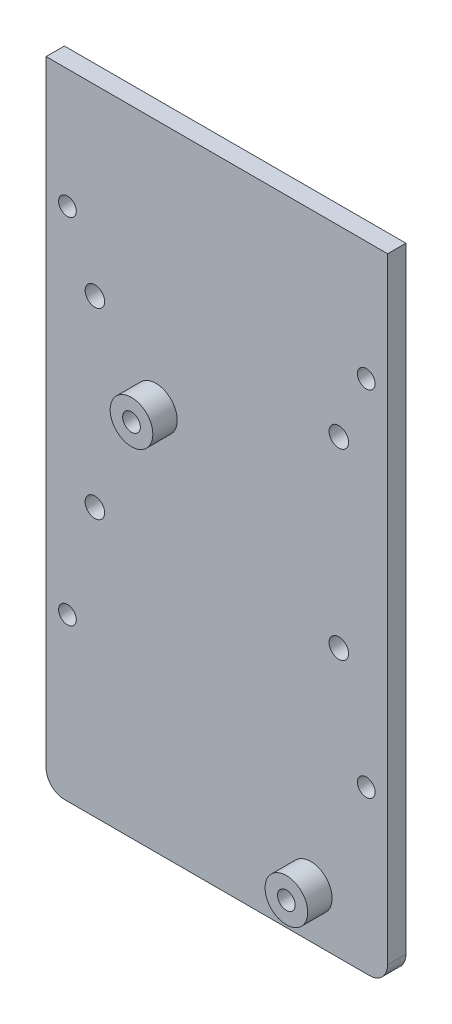
ISO-10303-21;
HEADER;
FILE_DESCRIPTION(('STEP AP214'),'2;1');
FILE_NAME('part.step','',(''),(''),'','','');
FILE_SCHEMA(('AUTOMOTIVE_DESIGN { 1 0 10303 214 1 1 1 1 }'));
ENDSEC;
DATA;
#1=APPLICATION_CONTEXT('core data for automotive mechanical design processes');
#2=APPLICATION_PROTOCOL_DEFINITION('international standard','automotive_design',2000,#1);
#3=PRODUCT_CONTEXT('',#1,'mechanical');
#4=PRODUCT('Part','Part','',(#3));
#5=PRODUCT_RELATED_PRODUCT_CATEGORY('part','',(#4));
#6=PRODUCT_DEFINITION_FORMATION('','',#4);
#7=PRODUCT_DEFINITION_CONTEXT('part definition',#1,'design');
#8=PRODUCT_DEFINITION('design','',#6,#7);
#9=PRODUCT_DEFINITION_SHAPE('','',#8);
#10=(LENGTH_UNIT() NAMED_UNIT(*) SI_UNIT(.MILLI.,.METRE.));
#11=(NAMED_UNIT(*) PLANE_ANGLE_UNIT() SI_UNIT($,.RADIAN.));
#12=(NAMED_UNIT(*) SI_UNIT($,.STERADIAN.) SOLID_ANGLE_UNIT());
#13=UNCERTAINTY_MEASURE_WITH_UNIT(LENGTH_MEASURE(1.E-05),#10,'distance_accuracy_value','');
#14=(GEOMETRIC_REPRESENTATION_CONTEXT(3) GLOBAL_UNCERTAINTY_ASSIGNED_CONTEXT((#13)) GLOBAL_UNIT_ASSIGNED_CONTEXT((#10,
#11,#12)) REPRESENTATION_CONTEXT('',''));
#15=CARTESIAN_POINT('',(0.,0.,0.));
#16=DIRECTION('',(0.,0.,1.));
#17=DIRECTION('',(1.,0.,0.));
#18=AXIS2_PLACEMENT_3D('',#15,#16,#17);
#19=CARTESIAN_POINT('',(-55.5668385634465,-35.1317121332508,3.));
#20=DIRECTION('',(0.,0.,1.));
#21=DIRECTION('',(1.,0.,0.));
#22=AXIS2_PLACEMENT_3D('',#19,#20,#21);
#23=PLANE('',#22);
#24=CARTESIAN_POINT('',(-15.1668385634479,-30.2317121332502,3.));
#25=DIRECTION('',(0.,0.,1.));
#26=DIRECTION('',(1.,0.,0.));
#27=AXIS2_PLACEMENT_3D('',#24,#25,#26);
#28=CIRCLE('',#27,3.5);
#29=CARTESIAN_POINT('',(-11.6668385634479,-30.2317121332502,3.));
#30=VERTEX_POINT('',#29);
#31=EDGE_CURVE('E229',#30,#30,#28,.T.);
#32=ORIENTED_EDGE('',*,*,#31,.F.);
#33=EDGE_LOOP('',(#32));
#34=FACE_BOUND('',#33,.T.);
#35=CARTESIAN_POINT('',(-55.0668385634466,46.3682878667495,3.));
#36=DIRECTION('',(0.,0.,1.));
#37=DIRECTION('',(-1.,0.,0.));
#38=AXIS2_PLACEMENT_3D('',#35,#36,#37);
#39=CIRCLE('',#38,1.45);
#40=CARTESIAN_POINT('',(-56.5168385634466,46.3682878667495,3.));
#41=VERTEX_POINT('',#40);
#42=EDGE_CURVE('E243',#41,#41,#39,.T.);
#43=ORIENTED_EDGE('',*,*,#42,.F.);
#44=EDGE_LOOP('',(#43));
#45=FACE_BOUND('',#44,.T.);
#46=CARTESIAN_POINT('',(-55.066838563447,-11.6317121332505,3.));
#47=DIRECTION('',(0.,0.,1.));
#48=DIRECTION('',(-1.,0.,0.));
#49=AXIS2_PLACEMENT_3D('',#46,#47,#48);
#50=CIRCLE('',#49,1.45);
#51=CARTESIAN_POINT('',(-56.516838563447,-11.6317121332505,3.));
#52=VERTEX_POINT('',#51);
#53=EDGE_CURVE('E248',#52,#52,#50,.T.);
#54=ORIENTED_EDGE('',*,*,#53,.F.);
#55=EDGE_LOOP('',(#54));
#56=FACE_BOUND('',#55,.T.);
#57=CARTESIAN_POINT('',(-6.06683856344624,-11.6317121332507,3.));
#58=DIRECTION('',(0.,0.,1.));
#59=DIRECTION('',(1.,0.,0.));
#60=AXIS2_PLACEMENT_3D('',#57,#58,#59);
#61=CIRCLE('',#60,1.45);
#62=CARTESIAN_POINT('',(-4.61683856344624,-11.6317121332507,3.));
#63=VERTEX_POINT('',#62);
#64=EDGE_CURVE('E254',#63,#63,#61,.T.);
#65=ORIENTED_EDGE('',*,*,#64,.F.);
#66=EDGE_LOOP('',(#65));
#67=FACE_BOUND('',#66,.T.);
#68=CARTESIAN_POINT('',(-6.06683856344624,46.3682878667493,3.));
#69=DIRECTION('',(0.,0.,1.));
#70=DIRECTION('',(1.,0.,0.));
#71=AXIS2_PLACEMENT_3D('',#68,#69,#70);
#72=CIRCLE('',#71,1.45);
#73=CARTESIAN_POINT('',(-4.61683856344624,46.3682878667493,3.));
#74=VERTEX_POINT('',#73);
#75=EDGE_CURVE('E260',#74,#74,#72,.T.);
#76=ORIENTED_EDGE('',*,*,#75,.F.);
#77=EDGE_LOOP('',(#76));
#78=FACE_BOUND('',#77,.T.);
#79=CARTESIAN_POINT('',(-10.5668385634465,35.8682878667493,3.));
#80=DIRECTION('',(0.,0.,1.));
#81=DIRECTION('',(-1.,0.,0.));
#82=AXIS2_PLACEMENT_3D('',#79,#80,#81);
#83=CIRCLE('',#82,1.60000000000023);
#84=CARTESIAN_POINT('',(-12.1668385634468,35.8682878667493,3.));
#85=VERTEX_POINT('',#84);
#86=EDGE_CURVE('E274',#85,#85,#83,.T.);
#87=ORIENTED_EDGE('',*,*,#86,.F.);
#88=EDGE_LOOP('',(#87));
#89=FACE_BOUND('',#88,.T.);
#90=CARTESIAN_POINT('',(-10.5668385634465,5.86828786674929,3.));
#91=DIRECTION('',(0.,0.,1.));
#92=DIRECTION('',(-1.,0.,0.));
#93=AXIS2_PLACEMENT_3D('',#90,#91,#92);
#94=CIRCLE('',#93,1.60000000000001);
#95=CARTESIAN_POINT('',(-12.1668385634465,5.86828786674929,3.));
#96=VERTEX_POINT('',#95);
#97=EDGE_CURVE('E278',#96,#96,#94,.T.);
#98=ORIENTED_EDGE('',*,*,#97,.F.);
#99=EDGE_LOOP('',(#98));
#100=FACE_BOUND('',#99,.T.);
#101=CARTESIAN_POINT('',(-50.5668385634463,5.86828786674928,3.));
#102=DIRECTION('',(0.,0.,1.));
#103=DIRECTION('',(1.,0.,0.));
#104=AXIS2_PLACEMENT_3D('',#101,#102,#103);
#105=CIRCLE('',#104,1.60000000000001);
#106=CARTESIAN_POINT('',(-48.9668385634463,5.86828786674928,3.));
#107=VERTEX_POINT('',#106);
#108=EDGE_CURVE('E284',#107,#107,#105,.T.);
#109=ORIENTED_EDGE('',*,*,#108,.F.);
#110=EDGE_LOOP('',(#109));
#111=FACE_BOUND('',#110,.T.);
#112=CARTESIAN_POINT('',(-50.5668385634462,35.8682878667493,3.));
#113=DIRECTION('',(0.,0.,1.));
#114=DIRECTION('',(1.,0.,0.));
#115=AXIS2_PLACEMENT_3D('',#112,#113,#114);
#116=CIRCLE('',#115,1.60000000000023);
#117=CARTESIAN_POINT('',(-48.966838563446,35.8682878667493,3.));
#118=VERTEX_POINT('',#117);
#119=EDGE_CURVE('E290',#118,#118,#116,.T.);
#120=ORIENTED_EDGE('',*,*,#119,.F.);
#121=EDGE_LOOP('',(#120));
#122=FACE_BOUND('',#121,.T.);
#123=CARTESIAN_POINT('',(-55.5668385634465,-35.1317121332508,3.));
#124=DIRECTION('',(0.,0.,1.));
#125=DIRECTION('',(1.,0.,0.));
#126=AXIS2_PLACEMENT_3D('',#123,#124,#125);
#127=CIRCLE('',#126,2.99999999999995);
#128=CARTESIAN_POINT('',(-58.5668385634464,-35.1317121332508,3.));
#129=VERTEX_POINT('',#128);
#130=CARTESIAN_POINT('',(-55.5668385634479,-38.1317121332507,3.));
#131=VERTEX_POINT('',#130);
#132=EDGE_CURVE('E132',#129,#131,#127,.T.);
#133=ORIENTED_EDGE('',*,*,#132,.T.);
#134=DIRECTION('',(1.,0.,0.));
#135=VECTOR('',#134,1.);
#136=CARTESIAN_POINT('',(-55.5668385634479,-38.1317121332507,3.));
#137=LINE('',#136,#135);
#138=CARTESIAN_POINT('',(-5.56683856344491,-38.1317121332507,3.));
#139=VERTEX_POINT('',#138);
#140=EDGE_CURVE('E90',#131,#139,#137,.T.);
#141=ORIENTED_EDGE('',*,*,#140,.T.);
#142=CARTESIAN_POINT('',(-5.56683856344638,-35.1317121332506,3.));
#143=DIRECTION('',(0.,0.,1.));
#144=DIRECTION('',(1.,0.,0.));
#145=AXIS2_PLACEMENT_3D('',#142,#143,#144);
#146=CIRCLE('',#145,3.00000000000013);
#147=CARTESIAN_POINT('',(-2.56683856344624,-35.1317121332507,3.));
#148=VERTEX_POINT('',#147);
#149=EDGE_CURVE('E103',#139,#148,#146,.T.);
#150=ORIENTED_EDGE('',*,*,#149,.T.);
#151=DIRECTION('',(0.,1.,0.));
#152=VECTOR('',#151,1.);
#153=CARTESIAN_POINT('',(-2.56683856344624,-35.1317121332507,3.));
#154=LINE('',#153,#152);
#155=CARTESIAN_POINT('',(-2.56683856344624,65.8682878667496,3.));
#156=VERTEX_POINT('',#155);
#157=EDGE_CURVE('E97',#148,#156,#154,.T.);
#158=ORIENTED_EDGE('',*,*,#157,.T.);
#159=DIRECTION('',(-1.,0.,0.));
#160=VECTOR('',#159,1.);
#161=CARTESIAN_POINT('',(-2.56683856344624,65.8682878667496,3.));
#162=LINE('',#161,#160);
#163=CARTESIAN_POINT('',(-58.5668385634464,65.8682878667493,3.));
#164=VERTEX_POINT('',#163);
#165=EDGE_CURVE('E101',#156,#164,#162,.T.);
#166=ORIENTED_EDGE('',*,*,#165,.T.);
#167=DIRECTION('',(0.,-1.,0.));
#168=VECTOR('',#167,1.);
#169=CARTESIAN_POINT('',(-58.5668385634464,65.8682878667493,3.));
#170=LINE('',#169,#168);
#171=EDGE_CURVE('E53',#164,#129,#170,.T.);
#172=ORIENTED_EDGE('',*,*,#171,.T.);
#173=EDGE_LOOP('',(#133,#141,#150,#158,#166,#172));
#174=FACE_BOUND('',#173,.T.);
#175=CARTESIAN_POINT('',(-40.5668385634471,24.9682878667495,3.));
#176=DIRECTION('',(0.,0.,1.));
#177=DIRECTION('',(1.,0.,0.));
#178=AXIS2_PLACEMENT_3D('',#175,#176,#177);
#179=CIRCLE('',#178,3.5);
#180=CARTESIAN_POINT('',(-37.0668385634471,24.9682878667495,3.));
#181=VERTEX_POINT('',#180);
#182=EDGE_CURVE('E234',#181,#181,#179,.T.);
#183=ORIENTED_EDGE('',*,*,#182,.F.);
#184=EDGE_LOOP('',(#183));
#185=FACE_BOUND('',#184,.T.);
#186=ADVANCED_FACE('F36',(#34,#45,#56,#67,#78,#89,#100,#111,#122,#174,#185),#23,.T.);
#187=CARTESIAN_POINT('',(-55.5668385634465,-35.1317121332508,3.));
#188=DIRECTION('',(0.,0.,-1.));
#189=DIRECTION('',(-1.,0.,0.));
#190=AXIS2_PLACEMENT_3D('',#187,#188,#189);
#191=CYLINDRICAL_SURFACE('',#190,2.99999999999995);
#192=CARTESIAN_POINT('',(-55.5668385634465,-35.1317121332508,0.));
#193=DIRECTION('',(0.,0.,1.));
#194=DIRECTION('',(1.,0.,0.));
#195=AXIS2_PLACEMENT_3D('',#192,#193,#194);
#196=CIRCLE('',#195,2.99999999999995);
#197=CARTESIAN_POINT('',(-58.5668385634464,-35.1317121332508,0.));
#198=VERTEX_POINT('',#197);
#199=CARTESIAN_POINT('',(-55.5668385634479,-38.1317121332507,0.));
#200=VERTEX_POINT('',#199);
#201=EDGE_CURVE('E121',#198,#200,#196,.T.);
#202=ORIENTED_EDGE('',*,*,#201,.T.);
#203=DIRECTION('',(0.,0.,-1.));
#204=VECTOR('',#203,1.);
#205=CARTESIAN_POINT('',(-55.5668385634479,-38.1317121332507,3.));
#206=LINE('',#205,#204);
#207=EDGE_CURVE('E11',#131,#200,#206,.T.);
#208=ORIENTED_EDGE('',*,*,#207,.F.);
#209=ORIENTED_EDGE('',*,*,#132,.F.);
#210=DIRECTION('',(0.,0.,-1.));
#211=VECTOR('',#210,1.);
#212=CARTESIAN_POINT('',(-58.5668385634464,-35.1317121332508,3.));
#213=LINE('',#212,#211);
#214=EDGE_CURVE('E117',#129,#198,#213,.T.);
#215=ORIENTED_EDGE('',*,*,#214,.T.);
#216=EDGE_LOOP('',(#202,#208,#209,#215));
#217=FACE_BOUND('',#216,.T.);
#218=ADVANCED_FACE('F38',(#217),#191,.T.);
#219=CARTESIAN_POINT('',(-55.5668385634479,-38.1317121332507,3.));
#220=DIRECTION('',(0.,1.,0.));
#221=DIRECTION('',(0.,0.,1.));
#222=AXIS2_PLACEMENT_3D('',#219,#220,#221);
#223=PLANE('',#222);
#224=DIRECTION('',(1.,0.,0.));
#225=VECTOR('',#224,1.);
#226=CARTESIAN_POINT('',(-55.5668385634479,-38.1317121332507,0.));
#227=LINE('',#226,#225);
#228=CARTESIAN_POINT('',(-5.56683856344491,-38.1317121332507,0.));
#229=VERTEX_POINT('',#228);
#230=EDGE_CURVE('E124',#200,#229,#227,.T.);
#231=ORIENTED_EDGE('',*,*,#230,.T.);
#232=DIRECTION('',(0.,0.,-1.));
#233=VECTOR('',#232,1.);
#234=CARTESIAN_POINT('',(-5.56683856344491,-38.1317121332507,3.));
#235=LINE('',#234,#233);
#236=EDGE_CURVE('E45',#139,#229,#235,.T.);
#237=ORIENTED_EDGE('',*,*,#236,.F.);
#238=ORIENTED_EDGE('',*,*,#140,.F.);
#239=ORIENTED_EDGE('',*,*,#207,.T.);
#240=EDGE_LOOP('',(#231,#237,#238,#239));
#241=FACE_BOUND('',#240,.T.);
#242=ADVANCED_FACE('F162',(#241),#223,.F.);
#243=CARTESIAN_POINT('',(-5.56683856344638,-35.1317121332506,3.));
#244=DIRECTION('',(0.,0.,-1.));
#245=DIRECTION('',(-1.,0.,0.));
#246=AXIS2_PLACEMENT_3D('',#243,#244,#245);
#247=CYLINDRICAL_SURFACE('',#246,3.00000000000013);
#248=CARTESIAN_POINT('',(-5.56683856344638,-35.1317121332506,0.));
#249=DIRECTION('',(0.,0.,1.));
#250=DIRECTION('',(1.,0.,0.));
#251=AXIS2_PLACEMENT_3D('',#248,#249,#250);
#252=CIRCLE('',#251,3.00000000000013);
#253=CARTESIAN_POINT('',(-2.56683856344624,-35.1317121332507,0.));
#254=VERTEX_POINT('',#253);
#255=EDGE_CURVE('E127',#229,#254,#252,.T.);
#256=ORIENTED_EDGE('',*,*,#255,.T.);
#257=DIRECTION('',(0.,0.,-1.));
#258=VECTOR('',#257,1.);
#259=CARTESIAN_POINT('',(-2.56683856344624,-35.1317121332507,3.));
#260=LINE('',#259,#258);
#261=EDGE_CURVE('E112',#148,#254,#260,.T.);
#262=ORIENTED_EDGE('',*,*,#261,.F.);
#263=ORIENTED_EDGE('',*,*,#149,.F.);
#264=ORIENTED_EDGE('',*,*,#236,.T.);
#265=EDGE_LOOP('',(#256,#262,#263,#264));
#266=FACE_BOUND('',#265,.T.);
#267=ADVANCED_FACE('F138',(#266),#247,.T.);
#268=CARTESIAN_POINT('',(-2.56683856344624,-35.1317121332507,3.));
#269=DIRECTION('',(-1.,0.,0.));
#270=DIRECTION('',(0.,0.,1.));
#271=AXIS2_PLACEMENT_3D('',#268,#269,#270);
#272=PLANE('',#271);
#273=DIRECTION('',(0.,1.,0.));
#274=VECTOR('',#273,1.);
#275=CARTESIAN_POINT('',(-2.56683856344624,-35.1317121332507,0.));
#276=LINE('',#275,#274);
#277=CARTESIAN_POINT('',(-2.56683856344624,65.8682878667496,0.));
#278=VERTEX_POINT('',#277);
#279=EDGE_CURVE('E111',#254,#278,#276,.T.);
#280=ORIENTED_EDGE('',*,*,#279,.T.);
#281=DIRECTION('',(0.,0.,-1.));
#282=VECTOR('',#281,1.);
#283=CARTESIAN_POINT('',(-2.56683856344624,65.8682878667496,3.));
#284=LINE('',#283,#282);
#285=EDGE_CURVE('E108',#156,#278,#284,.T.);
#286=ORIENTED_EDGE('',*,*,#285,.F.);
#287=ORIENTED_EDGE('',*,*,#157,.F.);
#288=ORIENTED_EDGE('',*,*,#261,.T.);
#289=EDGE_LOOP('',(#280,#286,#287,#288));
#290=FACE_BOUND('',#289,.T.);
#291=ADVANCED_FACE('F109',(#290),#272,.F.);
#292=CARTESIAN_POINT('',(-2.56683856344624,65.8682878667496,3.));
#293=DIRECTION('',(0.,-1.,0.));
#294=DIRECTION('',(1.,0.,0.));
#295=AXIS2_PLACEMENT_3D('',#292,#293,#294);
#296=PLANE('',#295);
#297=DIRECTION('',(-1.,0.,0.));
#298=VECTOR('',#297,1.);
#299=CARTESIAN_POINT('',(-2.56683856344624,65.8682878667496,0.));
#300=LINE('',#299,#298);
#301=CARTESIAN_POINT('',(-58.5668385634464,65.8682878667493,0.));
#302=VERTEX_POINT('',#301);
#303=EDGE_CURVE('E76',#278,#302,#300,.T.);
#304=ORIENTED_EDGE('',*,*,#303,.T.);
#305=DIRECTION('',(0.,0.,-1.));
#306=VECTOR('',#305,1.);
#307=CARTESIAN_POINT('',(-58.5668385634464,65.8682878667493,3.));
#308=LINE('',#307,#306);
#309=EDGE_CURVE('E113',#164,#302,#308,.T.);
#310=ORIENTED_EDGE('',*,*,#309,.F.);
#311=ORIENTED_EDGE('',*,*,#165,.F.);
#312=ORIENTED_EDGE('',*,*,#285,.T.);
#313=EDGE_LOOP('',(#304,#310,#311,#312));
#314=FACE_BOUND('',#313,.T.);
#315=ADVANCED_FACE('F115',(#314),#296,.F.);
#316=CARTESIAN_POINT('',(-58.5668385634464,65.8682878667493,3.));
#317=DIRECTION('',(1.,0.,0.));
#318=DIRECTION('',(0.,0.,-1.));
#319=AXIS2_PLACEMENT_3D('',#316,#317,#318);
#320=PLANE('',#319);
#321=DIRECTION('',(0.,-1.,0.));
#322=VECTOR('',#321,1.);
#323=CARTESIAN_POINT('',(-58.5668385634464,65.8682878667493,0.));
#324=LINE('',#323,#322);
#325=EDGE_CURVE('E82',#302,#198,#324,.T.);
#326=ORIENTED_EDGE('',*,*,#325,.T.);
#327=ORIENTED_EDGE('',*,*,#214,.F.);
#328=ORIENTED_EDGE('',*,*,#171,.F.);
#329=ORIENTED_EDGE('',*,*,#309,.T.);
#330=EDGE_LOOP('',(#326,#327,#328,#329));
#331=FACE_BOUND('',#330,.T.);
#332=ADVANCED_FACE('F145',(#331),#320,.F.);
#333=CARTESIAN_POINT('',(-55.5668385634465,-35.1317121332508,0.));
#334=DIRECTION('',(0.,0.,1.));
#335=DIRECTION('',(1.,0.,0.));
#336=AXIS2_PLACEMENT_3D('',#333,#334,#335);
#337=PLANE('',#336);
#338=CARTESIAN_POINT('',(-55.0668385634466,46.3682878667495,0.));
#339=DIRECTION('',(0.,0.,1.));
#340=DIRECTION('',(-1.,0.,0.));
#341=AXIS2_PLACEMENT_3D('',#338,#339,#340);
#342=CIRCLE('',#341,1.45);
#343=CARTESIAN_POINT('',(-56.5168385634466,46.3682878667495,0.));
#344=VERTEX_POINT('',#343);
#345=EDGE_CURVE('E245',#344,#344,#342,.T.);
#346=ORIENTED_EDGE('',*,*,#345,.T.);
#347=EDGE_LOOP('',(#346));
#348=FACE_BOUND('',#347,.T.);
#349=CARTESIAN_POINT('',(-55.066838563447,-11.6317121332505,0.));
#350=DIRECTION('',(0.,0.,1.));
#351=DIRECTION('',(-1.,0.,0.));
#352=AXIS2_PLACEMENT_3D('',#349,#350,#351);
#353=CIRCLE('',#352,1.45);
#354=CARTESIAN_POINT('',(-56.516838563447,-11.6317121332505,0.));
#355=VERTEX_POINT('',#354);
#356=EDGE_CURVE('E251',#355,#355,#353,.T.);
#357=ORIENTED_EDGE('',*,*,#356,.T.);
#358=EDGE_LOOP('',(#357));
#359=FACE_BOUND('',#358,.T.);
#360=CARTESIAN_POINT('',(-6.06683856344624,-11.6317121332507,0.));
#361=DIRECTION('',(0.,0.,1.));
#362=DIRECTION('',(1.,0.,0.));
#363=AXIS2_PLACEMENT_3D('',#360,#361,#362);
#364=CIRCLE('',#363,1.45);
#365=CARTESIAN_POINT('',(-4.61683856344624,-11.6317121332507,0.));
#366=VERTEX_POINT('',#365);
#367=EDGE_CURVE('E257',#366,#366,#364,.T.);
#368=ORIENTED_EDGE('',*,*,#367,.T.);
#369=EDGE_LOOP('',(#368));
#370=FACE_BOUND('',#369,.T.);
#371=CARTESIAN_POINT('',(-6.06683856344624,46.3682878667493,0.));
#372=DIRECTION('',(0.,0.,1.));
#373=DIRECTION('',(1.,0.,0.));
#374=AXIS2_PLACEMENT_3D('',#371,#372,#373);
#375=CIRCLE('',#374,1.45);
#376=CARTESIAN_POINT('',(-4.61683856344624,46.3682878667493,0.));
#377=VERTEX_POINT('',#376);
#378=EDGE_CURVE('E263',#377,#377,#375,.T.);
#379=ORIENTED_EDGE('',*,*,#378,.T.);
#380=EDGE_LOOP('',(#379));
#381=FACE_BOUND('',#380,.T.);
#382=CARTESIAN_POINT('',(-15.1668385634479,-30.2317121332502,0.));
#383=DIRECTION('',(0.,0.,1.));
#384=DIRECTION('',(1.,0.,0.));
#385=AXIS2_PLACEMENT_3D('',#382,#383,#384);
#386=CIRCLE('',#385,1.45);
#387=CARTESIAN_POINT('',(-13.7168385634479,-30.2317121332502,0.));
#388=VERTEX_POINT('',#387);
#389=EDGE_CURVE('E266',#388,#388,#386,.T.);
#390=ORIENTED_EDGE('',*,*,#389,.T.);
#391=EDGE_LOOP('',(#390));
#392=FACE_BOUND('',#391,.T.);
#393=CARTESIAN_POINT('',(-40.5668385634471,24.9682878667495,0.));
#394=DIRECTION('',(0.,0.,1.));
#395=DIRECTION('',(1.,0.,0.));
#396=AXIS2_PLACEMENT_3D('',#393,#394,#395);
#397=CIRCLE('',#396,1.45);
#398=CARTESIAN_POINT('',(-39.1168385634471,24.9682878667495,0.));
#399=VERTEX_POINT('',#398);
#400=EDGE_CURVE('E271',#399,#399,#397,.T.);
#401=ORIENTED_EDGE('',*,*,#400,.T.);
#402=EDGE_LOOP('',(#401));
#403=FACE_BOUND('',#402,.T.);
#404=CARTESIAN_POINT('',(-10.5668385634465,35.8682878667493,0.));
#405=DIRECTION('',(0.,0.,1.));
#406=DIRECTION('',(-1.,0.,0.));
#407=AXIS2_PLACEMENT_3D('',#404,#405,#406);
#408=CIRCLE('',#407,1.60000000000023);
#409=CARTESIAN_POINT('',(-12.1668385634468,35.8682878667493,0.));
#410=VERTEX_POINT('',#409);
#411=EDGE_CURVE('E275',#410,#410,#408,.T.);
#412=ORIENTED_EDGE('',*,*,#411,.T.);
#413=EDGE_LOOP('',(#412));
#414=FACE_BOUND('',#413,.T.);
#415=CARTESIAN_POINT('',(-10.5668385634465,5.86828786674929,0.));
#416=DIRECTION('',(0.,0.,1.));
#417=DIRECTION('',(-1.,0.,0.));
#418=AXIS2_PLACEMENT_3D('',#415,#416,#417);
#419=CIRCLE('',#418,1.60000000000001);
#420=CARTESIAN_POINT('',(-12.1668385634465,5.86828786674929,0.));
#421=VERTEX_POINT('',#420);
#422=EDGE_CURVE('E281',#421,#421,#419,.T.);
#423=ORIENTED_EDGE('',*,*,#422,.T.);
#424=EDGE_LOOP('',(#423));
#425=FACE_BOUND('',#424,.T.);
#426=CARTESIAN_POINT('',(-50.5668385634463,5.86828786674928,0.));
#427=DIRECTION('',(0.,0.,1.));
#428=DIRECTION('',(1.,0.,0.));
#429=AXIS2_PLACEMENT_3D('',#426,#427,#428);
#430=CIRCLE('',#429,1.60000000000001);
#431=CARTESIAN_POINT('',(-48.9668385634463,5.86828786674928,0.));
#432=VERTEX_POINT('',#431);
#433=EDGE_CURVE('E287',#432,#432,#430,.T.);
#434=ORIENTED_EDGE('',*,*,#433,.T.);
#435=EDGE_LOOP('',(#434));
#436=FACE_BOUND('',#435,.T.);
#437=CARTESIAN_POINT('',(-50.5668385634462,35.8682878667493,0.));
#438=DIRECTION('',(0.,0.,1.));
#439=DIRECTION('',(1.,0.,0.));
#440=AXIS2_PLACEMENT_3D('',#437,#438,#439);
#441=CIRCLE('',#440,1.60000000000023);
#442=CARTESIAN_POINT('',(-48.966838563446,35.8682878667493,0.));
#443=VERTEX_POINT('',#442);
#444=EDGE_CURVE('E125',#443,#443,#441,.T.);
#445=ORIENTED_EDGE('',*,*,#444,.T.);
#446=EDGE_LOOP('',(#445));
#447=FACE_BOUND('',#446,.T.);
#448=ORIENTED_EDGE('',*,*,#201,.F.);
#449=ORIENTED_EDGE('',*,*,#325,.F.);
#450=ORIENTED_EDGE('',*,*,#303,.F.);
#451=ORIENTED_EDGE('',*,*,#279,.F.);
#452=ORIENTED_EDGE('',*,*,#255,.F.);
#453=ORIENTED_EDGE('',*,*,#230,.F.);
#454=EDGE_LOOP('',(#448,#449,#450,#451,#452,#453));
#455=FACE_BOUND('',#454,.T.);
#456=ADVANCED_FACE('F141',(#348,#359,#370,#381,#392,#403,#414,#425,#436,#447,#455),#337,.F.);
#457=CARTESIAN_POINT('',(-50.5668385634462,35.8682878667493,0.));
#458=DIRECTION('',(0.,0.,1.));
#459=DIRECTION('',(1.,0.,0.));
#460=AXIS2_PLACEMENT_3D('',#457,#458,#459);
#461=CYLINDRICAL_SURFACE('',#460,1.60000000000023);
#462=ORIENTED_EDGE('',*,*,#444,.F.);
#463=EDGE_LOOP('',(#462));
#464=FACE_BOUND('',#463,.T.);
#465=ORIENTED_EDGE('',*,*,#119,.T.);
#466=EDGE_LOOP('',(#465));
#467=FACE_BOUND('',#466,.T.);
#468=ADVANCED_FACE('F152',(#464,#467),#461,.F.);
#469=CARTESIAN_POINT('',(-50.5668385634463,5.86828786674928,0.));
#470=DIRECTION('',(0.,0.,1.));
#471=DIRECTION('',(1.,0.,0.));
#472=AXIS2_PLACEMENT_3D('',#469,#470,#471);
#473=CYLINDRICAL_SURFACE('',#472,1.60000000000001);
#474=ORIENTED_EDGE('',*,*,#433,.F.);
#475=EDGE_LOOP('',(#474));
#476=FACE_BOUND('',#475,.T.);
#477=ORIENTED_EDGE('',*,*,#108,.T.);
#478=EDGE_LOOP('',(#477));
#479=FACE_BOUND('',#478,.T.);
#480=ADVANCED_FACE('F168',(#476,#479),#473,.F.);
#481=CARTESIAN_POINT('',(-10.5668385634465,5.86828786674929,0.));
#482=DIRECTION('',(0.,0.,1.));
#483=DIRECTION('',(1.,0.,0.));
#484=AXIS2_PLACEMENT_3D('',#481,#482,#483);
#485=CYLINDRICAL_SURFACE('',#484,1.60000000000001);
#486=ORIENTED_EDGE('',*,*,#422,.F.);
#487=EDGE_LOOP('',(#486));
#488=FACE_BOUND('',#487,.T.);
#489=ORIENTED_EDGE('',*,*,#97,.T.);
#490=EDGE_LOOP('',(#489));
#491=FACE_BOUND('',#490,.T.);
#492=ADVANCED_FACE('F172',(#488,#491),#485,.F.);
#493=CARTESIAN_POINT('',(-10.5668385634465,35.8682878667493,0.));
#494=DIRECTION('',(0.,0.,1.));
#495=DIRECTION('',(1.,0.,0.));
#496=AXIS2_PLACEMENT_3D('',#493,#494,#495);
#497=CYLINDRICAL_SURFACE('',#496,1.60000000000023);
#498=ORIENTED_EDGE('',*,*,#411,.F.);
#499=EDGE_LOOP('',(#498));
#500=FACE_BOUND('',#499,.T.);
#501=ORIENTED_EDGE('',*,*,#86,.T.);
#502=EDGE_LOOP('',(#501));
#503=FACE_BOUND('',#502,.T.);
#504=ADVANCED_FACE('F176',(#500,#503),#497,.F.);
#505=CARTESIAN_POINT('',(-40.5668385634471,24.9682878667495,0.));
#506=DIRECTION('',(0.,0.,1.));
#507=DIRECTION('',(1.,0.,0.));
#508=AXIS2_PLACEMENT_3D('',#505,#506,#507);
#509=CYLINDRICAL_SURFACE('',#508,1.45);
#510=ORIENTED_EDGE('',*,*,#400,.F.);
#511=EDGE_LOOP('',(#510));
#512=FACE_BOUND('',#511,.T.);
#513=CARTESIAN_POINT('',(-40.5668385634471,24.9682878667495,7.));
#514=DIRECTION('',(0.,0.,1.));
#515=DIRECTION('',(1.,0.,0.));
#516=AXIS2_PLACEMENT_3D('',#513,#514,#515);
#517=CIRCLE('',#516,1.45);
#518=CARTESIAN_POINT('',(-39.1168385634471,24.9682878667495,7.));
#519=VERTEX_POINT('',#518);
#520=EDGE_CURVE('E225',#519,#519,#517,.F.);
#521=ORIENTED_EDGE('',*,*,#520,.F.);
#522=EDGE_LOOP('',(#521));
#523=FACE_BOUND('',#522,.T.);
#524=ADVANCED_FACE('F180',(#512,#523),#509,.F.);
#525=CARTESIAN_POINT('',(-15.1668385634479,-30.2317121332502,0.));
#526=DIRECTION('',(0.,0.,1.));
#527=DIRECTION('',(1.,0.,0.));
#528=AXIS2_PLACEMENT_3D('',#525,#526,#527);
#529=CYLINDRICAL_SURFACE('',#528,1.45);
#530=ORIENTED_EDGE('',*,*,#389,.F.);
#531=EDGE_LOOP('',(#530));
#532=FACE_BOUND('',#531,.T.);
#533=CARTESIAN_POINT('',(-15.1668385634479,-30.2317121332502,7.));
#534=DIRECTION('',(0.,0.,1.));
#535=DIRECTION('',(1.,0.,0.));
#536=AXIS2_PLACEMENT_3D('',#533,#534,#535);
#537=CIRCLE('',#536,1.45);
#538=CARTESIAN_POINT('',(-13.7168385634479,-30.2317121332502,7.));
#539=VERTEX_POINT('',#538);
#540=EDGE_CURVE('E232',#539,#539,#537,.F.);
#541=ORIENTED_EDGE('',*,*,#540,.F.);
#542=EDGE_LOOP('',(#541));
#543=FACE_BOUND('',#542,.T.);
#544=ADVANCED_FACE('F184',(#532,#543),#529,.F.);
#545=CARTESIAN_POINT('',(-6.06683856344624,46.3682878667493,0.));
#546=DIRECTION('',(0.,0.,1.));
#547=DIRECTION('',(1.,0.,0.));
#548=AXIS2_PLACEMENT_3D('',#545,#546,#547);
#549=CYLINDRICAL_SURFACE('',#548,1.45);
#550=ORIENTED_EDGE('',*,*,#378,.F.);
#551=EDGE_LOOP('',(#550));
#552=FACE_BOUND('',#551,.T.);
#553=ORIENTED_EDGE('',*,*,#75,.T.);
#554=EDGE_LOOP('',(#553));
#555=FACE_BOUND('',#554,.T.);
#556=ADVANCED_FACE('F188',(#552,#555),#549,.F.);
#557=CARTESIAN_POINT('',(-6.06683856344624,-11.6317121332507,0.));
#558=DIRECTION('',(0.,0.,1.));
#559=DIRECTION('',(1.,0.,0.));
#560=AXIS2_PLACEMENT_3D('',#557,#558,#559);
#561=CYLINDRICAL_SURFACE('',#560,1.45);
#562=ORIENTED_EDGE('',*,*,#367,.F.);
#563=EDGE_LOOP('',(#562));
#564=FACE_BOUND('',#563,.T.);
#565=ORIENTED_EDGE('',*,*,#64,.T.);
#566=EDGE_LOOP('',(#565));
#567=FACE_BOUND('',#566,.T.);
#568=ADVANCED_FACE('F192',(#564,#567),#561,.F.);
#569=CARTESIAN_POINT('',(-55.066838563447,-11.6317121332505,0.));
#570=DIRECTION('',(0.,0.,1.));
#571=DIRECTION('',(1.,0.,0.));
#572=AXIS2_PLACEMENT_3D('',#569,#570,#571);
#573=CYLINDRICAL_SURFACE('',#572,1.45);
#574=ORIENTED_EDGE('',*,*,#356,.F.);
#575=EDGE_LOOP('',(#574));
#576=FACE_BOUND('',#575,.T.);
#577=ORIENTED_EDGE('',*,*,#53,.T.);
#578=EDGE_LOOP('',(#577));
#579=FACE_BOUND('',#578,.T.);
#580=ADVANCED_FACE('F196',(#576,#579),#573,.F.);
#581=CARTESIAN_POINT('',(-55.0668385634466,46.3682878667495,0.));
#582=DIRECTION('',(0.,0.,1.));
#583=DIRECTION('',(1.,0.,0.));
#584=AXIS2_PLACEMENT_3D('',#581,#582,#583);
#585=CYLINDRICAL_SURFACE('',#584,1.45);
#586=ORIENTED_EDGE('',*,*,#345,.F.);
#587=EDGE_LOOP('',(#586));
#588=FACE_BOUND('',#587,.T.);
#589=ORIENTED_EDGE('',*,*,#42,.T.);
#590=EDGE_LOOP('',(#589));
#591=FACE_BOUND('',#590,.T.);
#592=ADVANCED_FACE('F200',(#588,#591),#585,.F.);
#593=CARTESIAN_POINT('',(-15.1668385634479,-30.2317121332502,7.));
#594=DIRECTION('',(0.,0.,-1.));
#595=DIRECTION('',(-1.,0.,0.));
#596=AXIS2_PLACEMENT_3D('',#593,#594,#595);
#597=CYLINDRICAL_SURFACE('',#596,3.5);
#598=CARTESIAN_POINT('',(-15.1668385634479,-30.2317121332502,7.));
#599=DIRECTION('',(0.,0.,1.));
#600=DIRECTION('',(1.,0.,0.));
#601=AXIS2_PLACEMENT_3D('',#598,#599,#600);
#602=CIRCLE('',#601,3.5);
#603=CARTESIAN_POINT('',(-11.6668385634479,-30.2317121332502,7.));
#604=VERTEX_POINT('',#603);
#605=EDGE_CURVE('E241',#604,#604,#602,.T.);
#606=ORIENTED_EDGE('',*,*,#605,.F.);
#607=EDGE_LOOP('',(#606));
#608=FACE_BOUND('',#607,.T.);
#609=ORIENTED_EDGE('',*,*,#31,.T.);
#610=EDGE_LOOP('',(#609));
#611=FACE_BOUND('',#610,.T.);
#612=ADVANCED_FACE('F204',(#608,#611),#597,.T.);
#613=CARTESIAN_POINT('',(0.,0.,7.));
#614=DIRECTION('',(0.,0.,1.));
#615=DIRECTION('',(1.,0.,0.));
#616=AXIS2_PLACEMENT_3D('',#613,#614,#615);
#617=PLANE('',#616);
#618=ORIENTED_EDGE('',*,*,#540,.T.);
#619=EDGE_LOOP('',(#618));
#620=FACE_BOUND('',#619,.T.);
#621=ORIENTED_EDGE('',*,*,#605,.T.);
#622=EDGE_LOOP('',(#621));
#623=FACE_BOUND('',#622,.T.);
#624=ADVANCED_FACE('F208',(#620,#623),#617,.T.);
#625=CARTESIAN_POINT('',(-40.5668385634471,24.9682878667495,7.));
#626=DIRECTION('',(0.,0.,-1.));
#627=DIRECTION('',(-1.,0.,0.));
#628=AXIS2_PLACEMENT_3D('',#625,#626,#627);
#629=CYLINDRICAL_SURFACE('',#628,3.5);
#630=CARTESIAN_POINT('',(-40.5668385634471,24.9682878667495,7.));
#631=DIRECTION('',(0.,0.,1.));
#632=DIRECTION('',(1.,0.,0.));
#633=AXIS2_PLACEMENT_3D('',#630,#631,#632);
#634=CIRCLE('',#633,3.5);
#635=CARTESIAN_POINT('',(-37.0668385634471,24.9682878667495,7.));
#636=VERTEX_POINT('',#635);
#637=EDGE_CURVE('E228',#636,#636,#634,.T.);
#638=ORIENTED_EDGE('',*,*,#637,.F.);
#639=EDGE_LOOP('',(#638));
#640=FACE_BOUND('',#639,.T.);
#641=ORIENTED_EDGE('',*,*,#182,.T.);
#642=EDGE_LOOP('',(#641));
#643=FACE_BOUND('',#642,.T.);
#644=ADVANCED_FACE('F212',(#640,#643),#629,.T.);
#645=CARTESIAN_POINT('',(0.,0.,7.));
#646=DIRECTION('',(0.,0.,1.));
#647=DIRECTION('',(1.,0.,0.));
#648=AXIS2_PLACEMENT_3D('',#645,#646,#647);
#649=PLANE('',#648);
#650=ORIENTED_EDGE('',*,*,#520,.T.);
#651=EDGE_LOOP('',(#650));
#652=FACE_BOUND('',#651,.T.);
#653=ORIENTED_EDGE('',*,*,#637,.T.);
#654=EDGE_LOOP('',(#653));
#655=FACE_BOUND('',#654,.T.);
#656=ADVANCED_FACE('F216',(#652,#655),#649,.T.);
#657=CLOSED_SHELL('',(#186,#218,#242,#267,#291,#315,#332,#456,#468,#480,#492,#504,#524,#544,
#556,#568,#580,#592,#612,#624,#644,#656));
#658=MANIFOLD_SOLID_BREP('B2',#657);
#659=ADVANCED_BREP_SHAPE_REPRESENTATION('',(#18,#658),#14);
#660=SHAPE_DEFINITION_REPRESENTATION(#9,#659);
ENDSEC;
END-ISO-10303-21;
